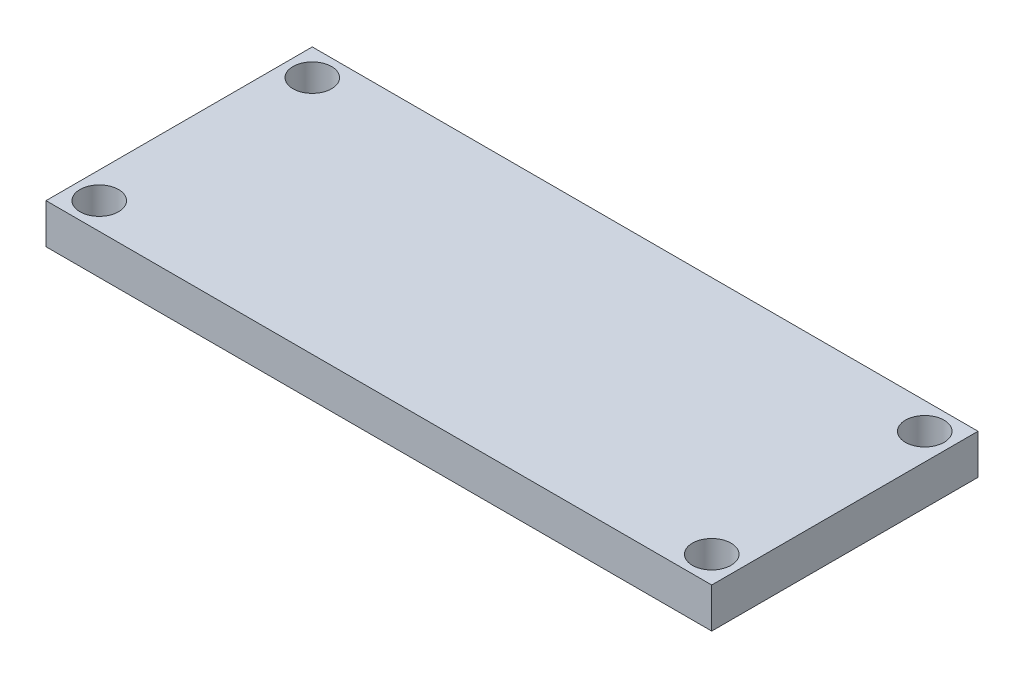
ISO-10303-21;
HEADER;
FILE_DESCRIPTION(('STEP AP214'),'2;1');
FILE_NAME('part.step','',(''),(''),'','','');
FILE_SCHEMA(('AUTOMOTIVE_DESIGN { 1 0 10303 214 1 1 1 1 }'));
ENDSEC;
DATA;
#1=APPLICATION_CONTEXT('core data for automotive mechanical design processes');
#2=APPLICATION_PROTOCOL_DEFINITION('international standard','automotive_design',2000,#1);
#3=PRODUCT_CONTEXT('',#1,'mechanical');
#4=PRODUCT('Part','Part','',(#3));
#5=PRODUCT_RELATED_PRODUCT_CATEGORY('part','',(#4));
#6=PRODUCT_DEFINITION_FORMATION('','',#4);
#7=PRODUCT_DEFINITION_CONTEXT('part definition',#1,'design');
#8=PRODUCT_DEFINITION('design','',#6,#7);
#9=PRODUCT_DEFINITION_SHAPE('','',#8);
#10=(LENGTH_UNIT() NAMED_UNIT(*) SI_UNIT(.MILLI.,.METRE.));
#11=(NAMED_UNIT(*) PLANE_ANGLE_UNIT() SI_UNIT($,.RADIAN.));
#12=(NAMED_UNIT(*) SI_UNIT($,.STERADIAN.) SOLID_ANGLE_UNIT());
#13=UNCERTAINTY_MEASURE_WITH_UNIT(LENGTH_MEASURE(1.E-05),#10,'distance_accuracy_value','');
#14=(GEOMETRIC_REPRESENTATION_CONTEXT(3) GLOBAL_UNCERTAINTY_ASSIGNED_CONTEXT((#13)) GLOBAL_UNIT_ASSIGNED_CONTEXT((#10,
#11,#12)) REPRESENTATION_CONTEXT('',''));
#15=CARTESIAN_POINT('',(0.,0.,0.));
#16=DIRECTION('',(0.,0.,1.));
#17=DIRECTION('',(1.,0.,0.));
#18=AXIS2_PLACEMENT_3D('',#15,#16,#17);
#19=CARTESIAN_POINT('',(-20.9859154929578,3.,-11.4084507042254));
#20=DIRECTION('',(1.,0.,0.));
#21=DIRECTION('',(0.,0.,-1.));
#22=AXIS2_PLACEMENT_3D('',#19,#20,#21);
#23=PLANE('',#22);
#24=DIRECTION('',(0.,0.,1.));
#25=VECTOR('',#24,1.);
#26=CARTESIAN_POINT('',(-20.9859154929578,0.,-11.4084507042254));
#27=LINE('',#26,#25);
#28=CARTESIAN_POINT('',(-20.9859154929578,0.,-11.4084507042254));
#29=VERTEX_POINT('',#28);
#30=CARTESIAN_POINT('',(-20.9859154929578,0.,8.59154929577465));
#31=VERTEX_POINT('',#30);
#32=EDGE_CURVE('E96',#29,#31,#27,.T.);
#33=ORIENTED_EDGE('',*,*,#32,.T.);
#34=DIRECTION('',(0.,-1.,0.));
#35=VECTOR('',#34,1.);
#36=CARTESIAN_POINT('',(-20.9859154929578,3.,8.59154929577465));
#37=LINE('',#36,#35);
#38=CARTESIAN_POINT('',(-20.9859154929578,3.,8.59154929577465));
#39=VERTEX_POINT('',#38);
#40=EDGE_CURVE('E11',#39,#31,#37,.T.);
#41=ORIENTED_EDGE('',*,*,#40,.F.);
#42=DIRECTION('',(0.,0.,1.));
#43=VECTOR('',#42,1.);
#44=CARTESIAN_POINT('',(-20.9859154929578,3.,-11.4084507042254));
#45=LINE('',#44,#43);
#46=CARTESIAN_POINT('',(-20.9859154929578,3.,-11.4084507042254));
#47=VERTEX_POINT('',#46);
#48=EDGE_CURVE('E84',#47,#39,#45,.T.);
#49=ORIENTED_EDGE('',*,*,#48,.F.);
#50=DIRECTION('',(0.,-1.,0.));
#51=VECTOR('',#50,1.);
#52=CARTESIAN_POINT('',(-20.9859154929578,3.,-11.4084507042254));
#53=LINE('',#52,#51);
#54=EDGE_CURVE('E92',#47,#29,#53,.T.);
#55=ORIENTED_EDGE('',*,*,#54,.T.);
#56=EDGE_LOOP('',(#33,#41,#49,#55));
#57=FACE_BOUND('',#56,.T.);
#58=ADVANCED_FACE('F33',(#57),#23,.F.);
#59=CARTESIAN_POINT('',(-20.9859154929578,3.,8.59154929577465));
#60=DIRECTION('',(0.,0.,-1.));
#61=DIRECTION('',(-1.,0.,0.));
#62=AXIS2_PLACEMENT_3D('',#59,#60,#61);
#63=PLANE('',#62);
#64=DIRECTION('',(1.,0.,0.));
#65=VECTOR('',#64,1.);
#66=CARTESIAN_POINT('',(-20.9859154929578,0.,8.59154929577465));
#67=LINE('',#66,#65);
#68=CARTESIAN_POINT('',(29.0140845070422,0.,8.59154929577465));
#69=VERTEX_POINT('',#68);
#70=EDGE_CURVE('E88',#31,#69,#67,.T.);
#71=ORIENTED_EDGE('',*,*,#70,.T.);
#72=DIRECTION('',(0.,-1.,0.));
#73=VECTOR('',#72,1.);
#74=CARTESIAN_POINT('',(29.0140845070422,3.,8.59154929577465));
#75=LINE('',#74,#73);
#76=CARTESIAN_POINT('',(29.0140845070422,3.,8.59154929577465));
#77=VERTEX_POINT('',#76);
#78=EDGE_CURVE('E41',#77,#69,#75,.T.);
#79=ORIENTED_EDGE('',*,*,#78,.F.);
#80=DIRECTION('',(1.,0.,0.));
#81=VECTOR('',#80,1.);
#82=CARTESIAN_POINT('',(-20.9859154929578,3.,8.59154929577465));
#83=LINE('',#82,#81);
#84=EDGE_CURVE('E79',#39,#77,#83,.T.);
#85=ORIENTED_EDGE('',*,*,#84,.F.);
#86=ORIENTED_EDGE('',*,*,#40,.T.);
#87=EDGE_LOOP('',(#71,#79,#85,#86));
#88=FACE_BOUND('',#87,.T.);
#89=ADVANCED_FACE('F87',(#88),#63,.F.);
#90=CARTESIAN_POINT('',(29.0140845070422,3.,-11.4084507042254));
#91=DIRECTION('',(-1.,0.,0.));
#92=DIRECTION('',(0.,0.,1.));
#93=AXIS2_PLACEMENT_3D('',#90,#91,#92);
#94=PLANE('',#93);
#95=DIRECTION('',(0.,0.,-1.));
#96=VECTOR('',#95,1.);
#97=CARTESIAN_POINT('',(29.0140845070422,0.,-11.4084507042254));
#98=LINE('',#97,#96);
#99=CARTESIAN_POINT('',(29.0140845070422,0.,-11.4084507042254));
#100=VERTEX_POINT('',#99);
#101=EDGE_CURVE('E66',#69,#100,#98,.T.);
#102=ORIENTED_EDGE('',*,*,#101,.T.);
#103=DIRECTION('',(0.,-1.,0.));
#104=VECTOR('',#103,1.);
#105=CARTESIAN_POINT('',(29.0140845070422,3.,-11.4084507042254));
#106=LINE('',#105,#104);
#107=CARTESIAN_POINT('',(29.0140845070422,3.,-11.4084507042254));
#108=VERTEX_POINT('',#107);
#109=EDGE_CURVE('E89',#108,#100,#106,.T.);
#110=ORIENTED_EDGE('',*,*,#109,.F.);
#111=DIRECTION('',(0.,0.,-1.));
#112=VECTOR('',#111,1.);
#113=CARTESIAN_POINT('',(29.0140845070422,3.,-11.4084507042254));
#114=LINE('',#113,#112);
#115=EDGE_CURVE('E82',#77,#108,#114,.T.);
#116=ORIENTED_EDGE('',*,*,#115,.F.);
#117=ORIENTED_EDGE('',*,*,#78,.T.);
#118=EDGE_LOOP('',(#102,#110,#116,#117));
#119=FACE_BOUND('',#118,.T.);
#120=ADVANCED_FACE('F90',(#119),#94,.F.);
#121=CARTESIAN_POINT('',(-20.9859154929578,3.,-11.4084507042254));
#122=DIRECTION('',(0.,0.,1.));
#123=DIRECTION('',(1.,0.,0.));
#124=AXIS2_PLACEMENT_3D('',#121,#122,#123);
#125=PLANE('',#124);
#126=DIRECTION('',(-1.,0.,0.));
#127=VECTOR('',#126,1.);
#128=CARTESIAN_POINT('',(-20.9859154929578,0.,-11.4084507042254));
#129=LINE('',#128,#127);
#130=EDGE_CURVE('E72',#100,#29,#129,.T.);
#131=ORIENTED_EDGE('',*,*,#130,.T.);
#132=ORIENTED_EDGE('',*,*,#54,.F.);
#133=DIRECTION('',(-1.,0.,0.));
#134=VECTOR('',#133,1.);
#135=CARTESIAN_POINT('',(-20.9859154929578,3.,-11.4084507042254));
#136=LINE('',#135,#134);
#137=EDGE_CURVE('E49',#108,#47,#136,.T.);
#138=ORIENTED_EDGE('',*,*,#137,.F.);
#139=ORIENTED_EDGE('',*,*,#109,.T.);
#140=EDGE_LOOP('',(#131,#132,#138,#139));
#141=FACE_BOUND('',#140,.T.);
#142=ADVANCED_FACE('F104',(#141),#125,.F.);
#143=CARTESIAN_POINT('',(0.,3.,0.));
#144=DIRECTION('',(0.,1.,0.));
#145=DIRECTION('',(0.,0.,1.));
#146=AXIS2_PLACEMENT_3D('',#143,#144,#145);
#147=PLANE('',#146);
#148=CARTESIAN_POINT('',(-18.9859154929578,3.,6.59154929577465));
#149=DIRECTION('',(0.,1.,0.));
#150=DIRECTION('',(0.,0.,1.));
#151=AXIS2_PLACEMENT_3D('',#148,#149,#150);
#152=CIRCLE('',#151,1.44999999999999);
#153=CARTESIAN_POINT('',(-18.9859154929578,3.,8.04154929577464));
#154=VERTEX_POINT('',#153);
#155=EDGE_CURVE('E130',#154,#154,#152,.T.);
#156=ORIENTED_EDGE('',*,*,#155,.F.);
#157=EDGE_LOOP('',(#156));
#158=FACE_BOUND('',#157,.T.);
#159=CARTESIAN_POINT('',(-18.9859154929578,3.,-9.40845070422535));
#160=DIRECTION('',(0.,1.,0.));
#161=DIRECTION('',(0.,0.,1.));
#162=AXIS2_PLACEMENT_3D('',#159,#160,#161);
#163=CIRCLE('',#162,1.44999999999999);
#164=CARTESIAN_POINT('',(-18.9859154929578,3.,-7.95845070422536));
#165=VERTEX_POINT('',#164);
#166=EDGE_CURVE('E124',#165,#165,#163,.T.);
#167=ORIENTED_EDGE('',*,*,#166,.F.);
#168=EDGE_LOOP('',(#167));
#169=FACE_BOUND('',#168,.T.);
#170=CARTESIAN_POINT('',(27.0140845070422,3.,6.59154929577465));
#171=DIRECTION('',(0.,1.,0.));
#172=DIRECTION('',(0.,0.,1.));
#173=AXIS2_PLACEMENT_3D('',#170,#171,#172);
#174=CIRCLE('',#173,1.44999999999999);
#175=CARTESIAN_POINT('',(27.0140845070422,3.,8.04154929577464));
#176=VERTEX_POINT('',#175);
#177=EDGE_CURVE('E118',#176,#176,#174,.T.);
#178=ORIENTED_EDGE('',*,*,#177,.F.);
#179=EDGE_LOOP('',(#178));
#180=FACE_BOUND('',#179,.T.);
#181=CARTESIAN_POINT('',(27.0140845070422,3.,-9.40845070422535));
#182=DIRECTION('',(0.,1.,0.));
#183=DIRECTION('',(0.,0.,1.));
#184=AXIS2_PLACEMENT_3D('',#181,#182,#183);
#185=CIRCLE('',#184,1.44999999999999);
#186=CARTESIAN_POINT('',(27.0140845070422,3.,-7.95845070422536));
#187=VERTEX_POINT('',#186);
#188=EDGE_CURVE('E112',#187,#187,#185,.T.);
#189=ORIENTED_EDGE('',*,*,#188,.F.);
#190=EDGE_LOOP('',(#189));
#191=FACE_BOUND('',#190,.T.);
#192=ORIENTED_EDGE('',*,*,#48,.T.);
#193=ORIENTED_EDGE('',*,*,#84,.T.);
#194=ORIENTED_EDGE('',*,*,#115,.T.);
#195=ORIENTED_EDGE('',*,*,#137,.T.);
#196=EDGE_LOOP('',(#192,#193,#194,#195));
#197=FACE_BOUND('',#196,.T.);
#198=ADVANCED_FACE('F80',(#158,#169,#180,#191,#197),#147,.T.);
#199=CARTESIAN_POINT('',(0.,0.,0.));
#200=DIRECTION('',(0.,1.,0.));
#201=DIRECTION('',(0.,0.,1.));
#202=AXIS2_PLACEMENT_3D('',#199,#200,#201);
#203=PLANE('',#202);
#204=CARTESIAN_POINT('',(-18.9859154929578,0.,6.59154929577465));
#205=DIRECTION('',(0.,1.,0.));
#206=DIRECTION('',(0.,0.,1.));
#207=AXIS2_PLACEMENT_3D('',#204,#205,#206);
#208=CIRCLE('',#207,1.44999999999999);
#209=CARTESIAN_POINT('',(-18.9859154929578,0.,8.04154929577464));
#210=VERTEX_POINT('',#209);
#211=EDGE_CURVE('E127',#210,#210,#208,.T.);
#212=ORIENTED_EDGE('',*,*,#211,.T.);
#213=EDGE_LOOP('',(#212));
#214=FACE_BOUND('',#213,.T.);
#215=CARTESIAN_POINT('',(-18.9859154929578,0.,-9.40845070422535));
#216=DIRECTION('',(0.,1.,0.));
#217=DIRECTION('',(0.,0.,1.));
#218=AXIS2_PLACEMENT_3D('',#215,#216,#217);
#219=CIRCLE('',#218,1.44999999999999);
#220=CARTESIAN_POINT('',(-18.9859154929578,0.,-7.95845070422537));
#221=VERTEX_POINT('',#220);
#222=EDGE_CURVE('E121',#221,#221,#219,.T.);
#223=ORIENTED_EDGE('',*,*,#222,.T.);
#224=EDGE_LOOP('',(#223));
#225=FACE_BOUND('',#224,.T.);
#226=CARTESIAN_POINT('',(27.0140845070422,0.,6.59154929577465));
#227=DIRECTION('',(0.,1.,0.));
#228=DIRECTION('',(0.,0.,1.));
#229=AXIS2_PLACEMENT_3D('',#226,#227,#228);
#230=CIRCLE('',#229,1.44999999999999);
#231=CARTESIAN_POINT('',(27.0140845070422,0.,8.04154929577463));
#232=VERTEX_POINT('',#231);
#233=EDGE_CURVE('E115',#232,#232,#230,.T.);
#234=ORIENTED_EDGE('',*,*,#233,.T.);
#235=EDGE_LOOP('',(#234));
#236=FACE_BOUND('',#235,.T.);
#237=CARTESIAN_POINT('',(27.0140845070422,0.,-9.40845070422535));
#238=DIRECTION('',(0.,1.,0.));
#239=DIRECTION('',(0.,0.,1.));
#240=AXIS2_PLACEMENT_3D('',#237,#238,#239);
#241=CIRCLE('',#240,1.44999999999999);
#242=CARTESIAN_POINT('',(27.0140845070422,0.,-7.95845070422537));
#243=VERTEX_POINT('',#242);
#244=EDGE_CURVE('E99',#243,#243,#241,.T.);
#245=ORIENTED_EDGE('',*,*,#244,.T.);
#246=EDGE_LOOP('',(#245));
#247=FACE_BOUND('',#246,.T.);
#248=ORIENTED_EDGE('',*,*,#32,.F.);
#249=ORIENTED_EDGE('',*,*,#130,.F.);
#250=ORIENTED_EDGE('',*,*,#101,.F.);
#251=ORIENTED_EDGE('',*,*,#70,.F.);
#252=EDGE_LOOP('',(#248,#249,#250,#251));
#253=FACE_BOUND('',#252,.T.);
#254=ADVANCED_FACE('F107',(#214,#225,#236,#247,#253),#203,.F.);
#255=CARTESIAN_POINT('',(27.0140845070422,3.,-9.40845070422535));
#256=DIRECTION('',(0.,1.,0.));
#257=DIRECTION('',(0.,0.,1.));
#258=AXIS2_PLACEMENT_3D('',#255,#256,#257);
#259=CYLINDRICAL_SURFACE('',#258,1.44999999999999);
#260=ORIENTED_EDGE('',*,*,#244,.F.);
#261=EDGE_LOOP('',(#260));
#262=FACE_BOUND('',#261,.T.);
#263=ORIENTED_EDGE('',*,*,#188,.T.);
#264=EDGE_LOOP('',(#263));
#265=FACE_BOUND('',#264,.T.);
#266=ADVANCED_FACE('F145',(#262,#265),#259,.F.);
#267=CARTESIAN_POINT('',(27.0140845070422,3.,6.59154929577465));
#268=DIRECTION('',(0.,1.,0.));
#269=DIRECTION('',(0.,0.,1.));
#270=AXIS2_PLACEMENT_3D('',#267,#268,#269);
#271=CYLINDRICAL_SURFACE('',#270,1.44999999999999);
#272=ORIENTED_EDGE('',*,*,#233,.F.);
#273=EDGE_LOOP('',(#272));
#274=FACE_BOUND('',#273,.T.);
#275=ORIENTED_EDGE('',*,*,#177,.T.);
#276=EDGE_LOOP('',(#275));
#277=FACE_BOUND('',#276,.T.);
#278=ADVANCED_FACE('F147',(#274,#277),#271,.F.);
#279=CARTESIAN_POINT('',(-18.9859154929578,3.,-9.40845070422535));
#280=DIRECTION('',(0.,1.,0.));
#281=DIRECTION('',(0.,0.,1.));
#282=AXIS2_PLACEMENT_3D('',#279,#280,#281);
#283=CYLINDRICAL_SURFACE('',#282,1.44999999999999);
#284=ORIENTED_EDGE('',*,*,#222,.F.);
#285=EDGE_LOOP('',(#284));
#286=FACE_BOUND('',#285,.T.);
#287=ORIENTED_EDGE('',*,*,#166,.T.);
#288=EDGE_LOOP('',(#287));
#289=FACE_BOUND('',#288,.T.);
#290=ADVANCED_FACE('F154',(#286,#289),#283,.F.);
#291=CARTESIAN_POINT('',(-18.9859154929578,3.,6.59154929577465));
#292=DIRECTION('',(0.,1.,0.));
#293=DIRECTION('',(0.,0.,1.));
#294=AXIS2_PLACEMENT_3D('',#291,#292,#293);
#295=CYLINDRICAL_SURFACE('',#294,1.44999999999999);
#296=ORIENTED_EDGE('',*,*,#211,.F.);
#297=EDGE_LOOP('',(#296));
#298=FACE_BOUND('',#297,.T.);
#299=ORIENTED_EDGE('',*,*,#155,.T.);
#300=EDGE_LOOP('',(#299));
#301=FACE_BOUND('',#300,.T.);
#302=ADVANCED_FACE('F134',(#298,#301),#295,.F.);
#303=CLOSED_SHELL('',(#58,#89,#120,#142,#198,#254,#266,#278,#290,#302));
#304=MANIFOLD_SOLID_BREP('B2',#303);
#305=ADVANCED_BREP_SHAPE_REPRESENTATION('',(#18,#304),#14);
#306=SHAPE_DEFINITION_REPRESENTATION(#9,#305);
ENDSEC;
END-ISO-10303-21;
